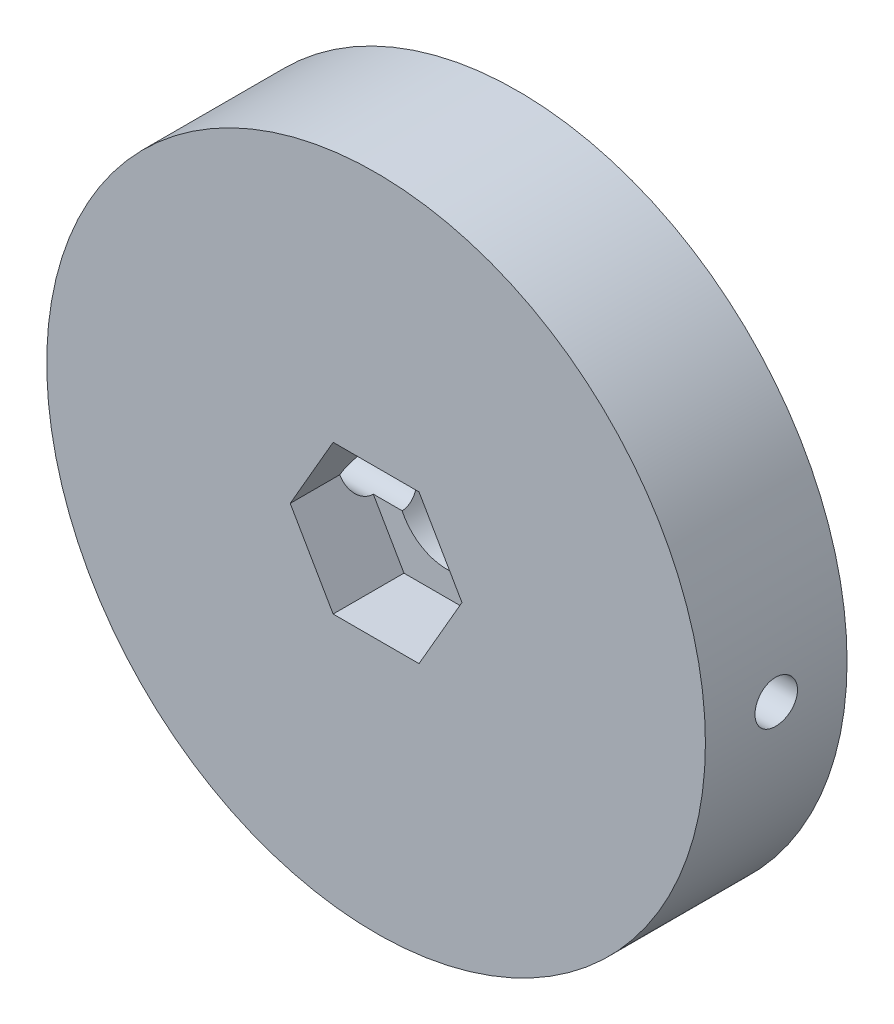
ISO-10303-21;
HEADER;
FILE_DESCRIPTION(('STEP AP214'),'2;1');
FILE_NAME('part.step','',(''),(''),'','','');
FILE_SCHEMA(('AUTOMOTIVE_DESIGN { 1 0 10303 214 1 1 1 1 }'));
ENDSEC;
DATA;
#1=APPLICATION_CONTEXT('core data for automotive mechanical design processes');
#2=APPLICATION_PROTOCOL_DEFINITION('international standard','automotive_design',2000,#1);
#3=PRODUCT_CONTEXT('',#1,'mechanical');
#4=PRODUCT('Part','Part','',(#3));
#5=PRODUCT_RELATED_PRODUCT_CATEGORY('part','',(#4));
#6=PRODUCT_DEFINITION_FORMATION('','',#4);
#7=PRODUCT_DEFINITION_CONTEXT('part definition',#1,'design');
#8=PRODUCT_DEFINITION('design','',#6,#7);
#9=PRODUCT_DEFINITION_SHAPE('','',#8);
#10=(LENGTH_UNIT() NAMED_UNIT(*) SI_UNIT(.MILLI.,.METRE.));
#11=(NAMED_UNIT(*) PLANE_ANGLE_UNIT() SI_UNIT($,.RADIAN.));
#12=(NAMED_UNIT(*) SI_UNIT($,.STERADIAN.) SOLID_ANGLE_UNIT());
#13=UNCERTAINTY_MEASURE_WITH_UNIT(LENGTH_MEASURE(1.E-05),#10,'distance_accuracy_value','');
#14=(GEOMETRIC_REPRESENTATION_CONTEXT(3) GLOBAL_UNCERTAINTY_ASSIGNED_CONTEXT((#13)) GLOBAL_UNIT_ASSIGNED_CONTEXT((#10,
#11,#12)) REPRESENTATION_CONTEXT('',''));
#15=CARTESIAN_POINT('',(0.,0.,0.));
#16=DIRECTION('',(0.,0.,1.));
#17=DIRECTION('',(1.,0.,0.));
#18=AXIS2_PLACEMENT_3D('',#15,#16,#17);
#19=CARTESIAN_POINT('',(0.,0.,10.));
#20=DIRECTION('',(0.,0.,-1.));
#21=DIRECTION('',(-1.,0.,0.));
#22=AXIS2_PLACEMENT_3D('',#19,#20,#21);
#23=CYLINDRICAL_SURFACE('',#22,3.5);
#24=CARTESIAN_POINT('',(0.,0.,0.));
#25=DIRECTION('',(0.,0.,1.));
#26=DIRECTION('',(1.,0.,0.));
#27=AXIS2_PLACEMENT_3D('',#24,#25,#26);
#28=CIRCLE('',#27,3.5);
#29=CARTESIAN_POINT('',(3.5,0.,0.));
#30=VERTEX_POINT('',#29);
#31=EDGE_CURVE('E263',#30,#30,#28,.T.);
#32=ORIENTED_EDGE('',*,*,#31,.F.);
#33=EDGE_LOOP('',(#32));
#34=FACE_BOUND('',#33,.T.);
#35=CARTESIAN_POINT('',(3.5,0.,3.5));
#36=CARTESIAN_POINT('',(3.49999299268884,-0.0801521976824074,3.50000922143898));
#37=CARTESIAN_POINT('',(3.4972151640971,-0.160419992198246,3.50646212975561));
#38=CARTESIAN_POINT('',(3.48637069204866,-0.318671611361218,3.53203970728539));
#39=CARTESIAN_POINT('',(3.47829069608751,-0.396649149090581,3.55119636978955));
#40=CARTESIAN_POINT('',(3.45770786336707,-0.547768164746414,3.60133527519899));
#41=CARTESIAN_POINT('',(3.44522036823866,-0.620925386146739,3.63227652746266));
#42=CARTESIAN_POINT('',(3.41702837926819,-0.760936446071888,3.70493210375049));
#43=CARTESIAN_POINT('',(3.40132475720839,-0.827791985611419,3.74664350915098));
#44=CARTESIAN_POINT('',(3.36733908702934,-0.956920783546129,3.84196385412534));
#45=CARTESIAN_POINT('',(3.34896947381213,-1.01882024425246,3.89604763807764));
#46=CARTESIAN_POINT('',(3.3120882776969,-1.13299518436931,4.01357192611615));
#47=CARTESIAN_POINT('',(3.29357662187922,-1.18526532055665,4.07701759007029));
#48=CARTESIAN_POINT('',(3.25741027462364,-1.28142843548186,4.21551636370652));
#49=CARTESIAN_POINT('',(3.23985230076501,-1.32473406006014,4.29100522964247));
#50=CARTESIAN_POINT('',(3.2089808436345,-1.39786599574425,4.44905471346701));
#51=CARTESIAN_POINT('',(3.19566505070703,-1.42769964537364,4.53161145208013));
#52=CARTESIAN_POINT('',(3.17573899533535,-1.47147459991436,4.69715036930945));
#53=CARTESIAN_POINT('',(3.16882610719817,-1.48613747209695,4.77990385092736));
#54=CARTESIAN_POINT('',(3.16162424842019,-1.50140303570396,4.94696298476757));
#55=CARTESIAN_POINT('',(3.16133131294301,-1.50201414304565,5.03126767764994));
#56=CARTESIAN_POINT('',(3.16714786968021,-1.48969999758096,5.19164995184879));
#57=CARTESIAN_POINT('',(3.17273435527608,-1.47788056910827,5.26783531160627));
#58=CARTESIAN_POINT('',(3.18879205821456,-1.44290386406528,5.41701379288904));
#59=CARTESIAN_POINT('',(3.19926427650311,-1.41974426417223,5.49000625692878));
#60=CARTESIAN_POINT('',(3.22415342810443,-1.36228829534658,5.63262357573777));
#61=CARTESIAN_POINT('',(3.23865147551049,-1.32775987214028,5.70214014711449));
#62=CARTESIAN_POINT('',(3.26994246945713,-1.24871152436691,5.8346731620293));
#63=CARTESIAN_POINT('',(3.28673634798109,-1.20418753740296,5.89768694746324));
#64=CARTESIAN_POINT('',(3.32256202266195,-1.10171702696058,6.02138875181234));
#65=CARTESIAN_POINT('',(3.34165927694226,-1.04292364428052,6.08135836473643));
#66=CARTESIAN_POINT('',(3.3786730287964,-0.915936662025533,6.19083579532753));
#67=CARTESIAN_POINT('',(3.39658921627429,-0.847740608139989,6.24034087293899));
#68=CARTESIAN_POINT('',(3.4297984684468,-0.701592911506315,6.32862196640361));
#69=CARTESIAN_POINT('',(3.44501227516835,-0.623435574851147,6.36708950935282));
#70=CARTESIAN_POINT('',(3.47048698130307,-0.460939847079478,6.43007511880733));
#71=CARTESIAN_POINT('',(3.48075078019998,-0.376605107828833,6.45460135298884));
#72=CARTESIAN_POINT('',(3.49461763446686,-0.210138119470685,6.48746693022949));
#73=CARTESIAN_POINT('',(3.49861624982293,-0.12822898050547,6.49676938265719));
#74=CARTESIAN_POINT('',(3.50077708325871,0.0360716505592619,6.50181478820412));
#75=CARTESIAN_POINT('',(3.49894110265833,0.118462985950311,6.4975619262662));
#76=CARTESIAN_POINT('',(3.48989338160075,0.276771219813305,6.47629218397258));
#77=CARTESIAN_POINT('',(3.48297259736823,0.352799465751996,6.4599658392758));
#78=CARTESIAN_POINT('',(3.46476944004986,0.500945568196324,6.41598955288096));
#79=CARTESIAN_POINT('',(3.45348652424256,0.573062936850433,6.38833820213907));
#80=CARTESIAN_POINT('',(3.42719375756864,0.713888482619006,6.32159942024878));
#81=CARTESIAN_POINT('',(3.41207852694255,0.782419874757532,6.28218183488638));
#82=CARTESIAN_POINT('',(3.37971494195701,0.912142452825177,6.19339052776262));
#83=CARTESIAN_POINT('',(3.36246567824312,0.973330487571132,6.14401255599057));
#84=CARTESIAN_POINT('',(3.32607394349023,1.09148379765634,6.03235520607617));
#85=CARTESIAN_POINT('',(3.30688677499573,1.14778308774279,5.96938389496011));
#86=CARTESIAN_POINT('',(3.26992018844849,1.24921715724402,5.83460885069339));
#87=CARTESIAN_POINT('',(3.25214116277359,1.29434883220193,5.76280266984699));
#88=CARTESIAN_POINT('',(3.21981484643715,1.37281937806384,5.61059307348568));
#89=CARTESIAN_POINT('',(3.20533127997694,1.40593207473353,5.53005849534316));
#90=CARTESIAN_POINT('',(3.18206803761103,1.45782942550893,5.36373683676198));
#91=CARTESIAN_POINT('',(3.17328328988834,1.47662682249981,5.27795450132941));
#92=CARTESIAN_POINT('',(3.16321740581935,1.49805974083904,5.11100441338137));
#93=CARTESIAN_POINT('',(3.16138962881681,1.50187346166243,5.03002036462019));
#94=CARTESIAN_POINT('',(3.16397809086751,1.49641325085791,4.86860512816848));
#95=CARTESIAN_POINT('',(3.16839322866983,1.48714162748685,4.7881738454847));
#96=CARTESIAN_POINT('',(3.1824582711803,1.45678214099437,4.63447914613377));
#97=CARTESIAN_POINT('',(3.19182357178317,1.43633482013379,4.56106058335268));
#98=CARTESIAN_POINT('',(3.21449437287189,1.38485117000436,4.41868963782594));
#99=CARTESIAN_POINT('',(3.22780099349553,1.35381183006239,4.34973853154671));
#100=CARTESIAN_POINT('',(3.25787626150961,1.27981602227022,4.2135895630917));
#101=CARTESIAN_POINT('',(3.27480834339631,1.23624027712767,4.14676510617978));
#102=CARTESIAN_POINT('',(3.3097987990854,1.13924888881305,4.02100913646911));
#103=CARTESIAN_POINT('',(3.32785759700647,1.08582952534294,3.96208062245602));
#104=CARTESIAN_POINT('',(3.36477750877144,0.965671675541752,3.84899690268563));
#105=CARTESIAN_POINT('',(3.38358948911939,0.898214817981345,3.79558526613148));
#106=CARTESIAN_POINT('',(3.41848089249468,0.754612613706936,3.70078507330686));
#107=CARTESIAN_POINT('',(3.43455907522587,0.678463349382711,3.65940196825022));
#108=CARTESIAN_POINT('',(3.46197513636854,0.520626802896572,3.59065543042933));
#109=CARTESIAN_POINT('',(3.47337868320289,0.439036402858197,3.5630964700207));
#110=CARTESIAN_POINT('',(3.49042295491409,0.271925657404337,3.5223652852328));
#111=CARTESIAN_POINT('',(3.49608152963086,0.186418352711325,3.50914849035336));
#112=CARTESIAN_POINT('',(3.49952115812385,0.0670267606132192,3.50111948904598));
#113=CARTESIAN_POINT('',(3.50000293079341,0.0335234910607503,3.4999961431522));
#114=CARTESIAN_POINT('',(3.5,0.,3.5));
#115=B_SPLINE_CURVE_WITH_KNOTS('',3,(#35,#36,#37,#38,#39,#40,#41,#42,#43,#44,#45,#46,#47,#48,
#49,#50,#51,#52,#53,#54,#55,#56,#57,#58,#59,#60,#61,#62,#63,#64,#65,#66,#67,#68,#69,#70,#71,#72,
#73,#74,#75,#76,#77,#78,#79,#80,#81,#82,#83,#84,#85,#86,#87,#88,#89,#90,#91,#92,#93,#94,#95,#96,
#97,#98,#99,#100,#101,#102,#103,#104,#105,#106,#107,#108,#109,#110,#111,#112,#113,#114),
.UNSPECIFIED.,.T.,.F.,(4,2,2,2,2,2,2,2,2,2,2,2,2,2,2,2,2,2,2,2,2,2,2,2,2,2,2,2,2,2,2,2,2,2,2,2,
2,2,2,4),(0.,0.240357161374425,0.481321951711674,0.721456131375709,0.961525304807658,
1.21311371779253,1.46484131710872,1.72984780430031,1.99470976114132,2.2462971341405,
2.49773382188957,2.72855360159807,2.95942069041216,3.19532704432402,3.43132944942385,
3.68854918859162,3.94583619550723,4.20973622296859,4.47348148178613,4.71978673747256,
4.96601595851026,5.19915597113058,5.43232499957122,5.67277527577345,5.91332836788289,
6.17201425189602,6.43077196675482,6.69417345394932,6.95734019712949,7.19934244432576,
7.44130200762144,7.67066022550943,7.90008369050323,8.14372375039557,8.38745608120076,
8.65042084666959,8.91350460007056,9.17275427816965,9.43119596989053,9.53172485598109),.UNSPECIFIED.);
#116=CARTESIAN_POINT('',(3.16227766016838,1.5,5.));
#117=VERTEX_POINT('',#116);
#118=CARTESIAN_POINT('',(3.16227766016838,-1.5,5.));
#119=VERTEX_POINT('',#118);
#120=EDGE_CURVE('E171',#117,#119,#115,.T.);
#121=ORIENTED_EDGE('',*,*,#120,.F.);
#122=CARTESIAN_POINT('',(0.,0.,5.));
#123=DIRECTION('',(0.,0.,1.));
#124=DIRECTION('',(1.,0.,0.));
#125=AXIS2_PLACEMENT_3D('',#122,#123,#124);
#126=CIRCLE('',#125,3.5);
#127=CARTESIAN_POINT('',(-3.16227766016838,1.5,5.));
#128=VERTEX_POINT('',#127);
#129=EDGE_CURVE('E157',#117,#128,#126,.T.);
#130=ORIENTED_EDGE('',*,*,#129,.T.);
#131=CARTESIAN_POINT('',(-3.5,0.,6.5));
#132=CARTESIAN_POINT('',(-3.49999299268885,-0.0801521976824066,6.49999077856102));
#133=CARTESIAN_POINT('',(-3.4972151640971,-0.160419992198245,6.4935378702444));
#134=CARTESIAN_POINT('',(-3.48637069204866,-0.318671611361216,6.46796029271462));
#135=CARTESIAN_POINT('',(-3.47829069608751,-0.396649149090579,6.44880363021045));
#136=CARTESIAN_POINT('',(-3.45770786336707,-0.547768164746412,6.39866472480102));
#137=CARTESIAN_POINT('',(-3.44522036823866,-0.620925386146736,6.36772347253735));
#138=CARTESIAN_POINT('',(-3.4170283792682,-0.760936446071885,6.29506789624952));
#139=CARTESIAN_POINT('',(-3.40132475720839,-0.827791985611416,6.25335649084902));
#140=CARTESIAN_POINT('',(-3.36733908702934,-0.956920783546126,6.15803614587467));
#141=CARTESIAN_POINT('',(-3.34896947381213,-1.01882024425246,6.10395236192237));
#142=CARTESIAN_POINT('',(-3.3120882776969,-1.13299518436931,5.98642807388386));
#143=CARTESIAN_POINT('',(-3.29357662187922,-1.18526532055664,5.92298240992972));
#144=CARTESIAN_POINT('',(-3.25741027462364,-1.28142843548186,5.78448363629348));
#145=CARTESIAN_POINT('',(-3.23985230076501,-1.32473406006014,5.70899477035753));
#146=CARTESIAN_POINT('',(-3.2089808436345,-1.39786599574424,5.55094528653299));
#147=CARTESIAN_POINT('',(-3.19566505070703,-1.42769964537364,5.46838854791988));
#148=CARTESIAN_POINT('',(-3.17573899533535,-1.47147459991436,5.30284963069055));
#149=CARTESIAN_POINT('',(-3.16882610719817,-1.48613747209695,5.22009614907264));
#150=CARTESIAN_POINT('',(-3.16162424842019,-1.50140303570396,5.05303701523244));
#151=CARTESIAN_POINT('',(-3.16133131294301,-1.50201414304565,4.96873232235007));
#152=CARTESIAN_POINT('',(-3.16714786968021,-1.48969999758096,4.80835004815122));
#153=CARTESIAN_POINT('',(-3.17273435527608,-1.47788056910827,4.73216468839374));
#154=CARTESIAN_POINT('',(-3.18879205821456,-1.44290386406528,4.58298620711097));
#155=CARTESIAN_POINT('',(-3.19926427650311,-1.41974426417223,4.50999374307123));
#156=CARTESIAN_POINT('',(-3.22415342810443,-1.36228829534658,4.36737642426223));
#157=CARTESIAN_POINT('',(-3.23865147551049,-1.32775987214028,4.29785985288551));
#158=CARTESIAN_POINT('',(-3.26994246945713,-1.24871152436691,4.16532683797071));
#159=CARTESIAN_POINT('',(-3.28673634798109,-1.20418753740296,4.10231305253676));
#160=CARTESIAN_POINT('',(-3.32256202266195,-1.10171702696058,3.97861124818766));
#161=CARTESIAN_POINT('',(-3.34165927694226,-1.04292364428052,3.91864163526357));
#162=CARTESIAN_POINT('',(-3.3786730287964,-0.915936662025533,3.80916420467247));
#163=CARTESIAN_POINT('',(-3.39658921627429,-0.847740608139988,3.75965912706102));
#164=CARTESIAN_POINT('',(-3.4297984684468,-0.701592911506315,3.67137803359639));
#165=CARTESIAN_POINT('',(-3.44501227516835,-0.623435574851147,3.63291049064718));
#166=CARTESIAN_POINT('',(-3.47048698130307,-0.460939847079478,3.56992488119267));
#167=CARTESIAN_POINT('',(-3.48075078019998,-0.376605107828833,3.54539864701116));
#168=CARTESIAN_POINT('',(-3.49461763446686,-0.210138119470685,3.51253306977051));
#169=CARTESIAN_POINT('',(-3.49861624982293,-0.12822898050547,3.50323061734281));
#170=CARTESIAN_POINT('',(-3.50077708325871,0.0360716505592612,3.49818521179589));
#171=CARTESIAN_POINT('',(-3.49894110265833,0.11846298595031,3.50243807373381));
#172=CARTESIAN_POINT('',(-3.48989338160075,0.276771219813304,3.52370781602742));
#173=CARTESIAN_POINT('',(-3.48297259736823,0.352799465751994,3.54003416072421));
#174=CARTESIAN_POINT('',(-3.46476944004986,0.500945568196321,3.58401044711904));
#175=CARTESIAN_POINT('',(-3.45348652424256,0.573062936850431,3.61166179786093));
#176=CARTESIAN_POINT('',(-3.42719375756864,0.713888482619004,3.67840057975122));
#177=CARTESIAN_POINT('',(-3.41207852694255,0.78241987475753,3.71781816511362));
#178=CARTESIAN_POINT('',(-3.37971494195701,0.912142452825174,3.80660947223738));
#179=CARTESIAN_POINT('',(-3.36246567824312,0.973330487571129,3.85598744400943));
#180=CARTESIAN_POINT('',(-3.32607394349023,1.09148379765634,3.96764479392383));
#181=CARTESIAN_POINT('',(-3.30688677499573,1.14778308774279,4.03061610503989));
#182=CARTESIAN_POINT('',(-3.26992018844849,1.24921715724402,4.16539114930661));
#183=CARTESIAN_POINT('',(-3.25214116277359,1.29434883220193,4.237197330153));
#184=CARTESIAN_POINT('',(-3.21981484643715,1.37281937806384,4.38940692651431));
#185=CARTESIAN_POINT('',(-3.20533127997694,1.40593207473353,4.46994150465684));
#186=CARTESIAN_POINT('',(-3.18206803761104,1.45782942550893,4.63626316323802));
#187=CARTESIAN_POINT('',(-3.17328328988834,1.47662682249981,4.72204549867059));
#188=CARTESIAN_POINT('',(-3.16321740581935,1.49805974083904,4.88899558661863));
#189=CARTESIAN_POINT('',(-3.16138962881681,1.50187346166243,4.96997963537981));
#190=CARTESIAN_POINT('',(-3.16397809086751,1.49641325085791,5.13139487183152));
#191=CARTESIAN_POINT('',(-3.16839322866983,1.48714162748685,5.2118261545153));
#192=CARTESIAN_POINT('',(-3.1824582711803,1.45678214099437,5.36552085386623));
#193=CARTESIAN_POINT('',(-3.19182357178317,1.43633482013379,5.43893941664732));
#194=CARTESIAN_POINT('',(-3.21449437287189,1.38485117000436,5.58131036217406));
#195=CARTESIAN_POINT('',(-3.22780099349553,1.35381183006239,5.65026146845329));
#196=CARTESIAN_POINT('',(-3.25787626150961,1.27981602227022,5.7864104369083));
#197=CARTESIAN_POINT('',(-3.27480834339631,1.23624027712767,5.85323489382022));
#198=CARTESIAN_POINT('',(-3.3097987990854,1.13924888881305,5.97899086353089));
#199=CARTESIAN_POINT('',(-3.32785759700647,1.08582952534293,6.03791937754398));
#200=CARTESIAN_POINT('',(-3.36477750877144,0.96567167554175,6.15100309731437));
#201=CARTESIAN_POINT('',(-3.38358948911939,0.898214817981343,6.20441473386853));
#202=CARTESIAN_POINT('',(-3.41848089249468,0.754612613706934,6.29921492669315));
#203=CARTESIAN_POINT('',(-3.43455907522587,0.67846334938271,6.34059803174978));
#204=CARTESIAN_POINT('',(-3.46197513636854,0.52062680289657,6.40934456957067));
#205=CARTESIAN_POINT('',(-3.47337868320289,0.439036402858197,6.43690352997931));
#206=CARTESIAN_POINT('',(-3.49042295491409,0.271925657404337,6.4776347147672));
#207=CARTESIAN_POINT('',(-3.49608152963086,0.186418352711325,6.49085150964664));
#208=CARTESIAN_POINT('',(-3.49952115812385,0.0670267606132196,6.49888051095403));
#209=CARTESIAN_POINT('',(-3.50000293079341,0.0335234910607508,6.5000038568478));
#210=CARTESIAN_POINT('',(-3.5,0.,6.5));
#211=B_SPLINE_CURVE_WITH_KNOTS('',3,(#131,#132,#133,#134,#135,#136,#137,#138,#139,#140,#141,
#142,#143,#144,#145,#146,#147,#148,#149,#150,#151,#152,#153,#154,#155,#156,#157,#158,#159,#160,
#161,#162,#163,#164,#165,#166,#167,#168,#169,#170,#171,#172,#173,#174,#175,#176,#177,#178,#179,
#180,#181,#182,#183,#184,#185,#186,#187,#188,#189,#190,#191,#192,#193,#194,#195,#196,#197,#198,
#199,#200,#201,#202,#203,#204,#205,#206,#207,#208,#209,#210),.UNSPECIFIED.,.T.,.F.,(4,2,2,2,2,2,
2,2,2,2,2,2,2,2,2,2,2,2,2,2,2,2,2,2,2,2,2,2,2,2,2,2,2,2,2,2,2,2,2,4),(0.,0.240357161374424,
0.481321951711673,0.721456131375707,0.961525304807654,1.21311371779253,1.46484131710871,
1.72984780430031,1.99470976114131,2.2462971341405,2.49773382188957,2.72855360159806,
2.95942069041216,3.19532704432402,3.43132944942385,3.68854918859162,3.94583619550723,
4.20973622296859,4.47348148178613,4.71978673747256,4.96601595851026,5.19915597113058,
5.43232499957121,5.67277527577344,5.91332836788288,6.17201425189601,6.43077196675482,
6.69417345394932,6.95734019712949,7.19934244432576,7.44130200762144,7.67066022550943,
7.90008369050323,8.14372375039557,8.38745608120077,8.65042084666959,8.91350460007056,
9.17275427816965,9.43119596989053,9.53172485598109),.UNSPECIFIED.);
#212=CARTESIAN_POINT('',(-3.16227766016838,-1.5,5.));
#213=VERTEX_POINT('',#212);
#214=EDGE_CURVE('E179',#213,#128,#211,.T.);
#215=ORIENTED_EDGE('',*,*,#214,.F.);
#216=EDGE_CURVE('E167',#213,#119,#126,.T.);
#217=ORIENTED_EDGE('',*,*,#216,.T.);
#218=EDGE_LOOP('',(#121,#130,#215,#217));
#219=FACE_BOUND('',#218,.T.);
#220=ADVANCED_FACE('F35',(#34,#219),#23,.F.);
#221=CARTESIAN_POINT('',(-23.25,0.,5.));
#222=DIRECTION('',(1.,0.,0.));
#223=DIRECTION('',(0.,0.,-1.));
#224=AXIS2_PLACEMENT_3D('',#221,#222,#223);
#225=CYLINDRICAL_SURFACE('',#224,1.5);
#226=CARTESIAN_POINT('',(23.25,0.,3.5));
#227=CARTESIAN_POINT('',(23.2499993575194,-0.0841617407544875,3.50000370098235));
#228=CARTESIAN_POINT('',(23.2495381336033,-0.168382273316844,3.50710700230322));
#229=CARTESIAN_POINT('',(23.2477425617024,-0.334497422879522,3.53534130107231));
#230=CARTESIAN_POINT('',(23.246407199784,-0.416389223487859,3.55648858888908));
#231=CARTESIAN_POINT('',(23.2430144034251,-0.575416705015012,3.61220058299807));
#232=CARTESIAN_POINT('',(23.2409573522777,-0.652554885091158,3.64675816803875));
#233=CARTESIAN_POINT('',(23.2363524812359,-0.799915643408826,3.72829814425515));
#234=CARTESIAN_POINT('',(23.2338047731445,-0.870139791609991,3.77527770581892));
#235=CARTESIAN_POINT('',(23.2285004008886,-1.00181051361919,3.88040958733033));
#236=CARTESIAN_POINT('',(23.2257434492315,-1.06324466351136,3.93857745419603));
#237=CARTESIAN_POINT('',(23.2203337645789,-1.17548521251709,4.06440263047956));
#238=CARTESIAN_POINT('',(23.2176810359603,-1.22629116567894,4.13206033788558));
#239=CARTESIAN_POINT('',(23.2127767164856,-1.31587187259357,4.2750155924208));
#240=CARTESIAN_POINT('',(23.2105254728961,-1.35463623219941,4.35031966581885));
#241=CARTESIAN_POINT('',(23.2066817436723,-1.41896687972332,4.50638431934662));
#242=CARTESIAN_POINT('',(23.2050892505724,-1.44453331721711,4.5871448376252));
#243=CARTESIAN_POINT('',(23.202745362278,-1.48170770781305,4.7517095827016));
#244=CARTESIAN_POINT('',(23.2019927884446,-1.49333522278137,4.83550937350919));
#245=CARTESIAN_POINT('',(23.2014100779356,-1.50236209714869,5.00387441508209));
#246=CARTESIAN_POINT('',(23.2015799302355,-1.49976162659779,5.08843965668682));
#247=CARTESIAN_POINT('',(23.2028218236265,-1.48042257456794,5.25580174498185));
#248=CARTESIAN_POINT('',(23.203892513396,-1.46370516937816,5.3386010500594));
#249=CARTESIAN_POINT('',(23.2068132964037,-1.41663964441904,5.50021582723453));
#250=CARTESIAN_POINT('',(23.2086633945616,-1.38629143861186,5.57903127418244));
#251=CARTESIAN_POINT('',(23.2129360588973,-1.31280177452263,5.7305090386428));
#252=CARTESIAN_POINT('',(23.2153590542523,-1.26965071897356,5.803166687431));
#253=CARTESIAN_POINT('',(23.2205040351617,-1.17178720727461,5.94021532815866));
#254=CARTESIAN_POINT('',(23.2232260243047,-1.11707461234881,6.00460622085536));
#255=CARTESIAN_POINT('',(23.2286682495912,-0.99752188518117,6.12341672918544));
#256=CARTESIAN_POINT('',(23.2313884734403,-0.93266342775974,6.17781790743294));
#257=CARTESIAN_POINT('',(23.2365158443952,-0.794724285488825,6.27496249205618));
#258=CARTESIAN_POINT('',(23.2389229913847,-0.72164359758723,6.3177058941045));
#259=CARTESIAN_POINT('',(23.2431531738402,-0.569323237578535,6.39032007152259));
#260=CARTESIAN_POINT('',(23.2449761771655,-0.490083226871654,6.42019013860797));
#261=CARTESIAN_POINT('',(23.2478322225902,-0.327698592784928,6.46619737789848));
#262=CARTESIAN_POINT('',(23.2488652745188,-0.24455401800245,6.4823347209774));
#263=CARTESIAN_POINT('',(23.2500237439872,-0.0768803815852869,6.5003955634332));
#264=CARTESIAN_POINT('',(23.2501507891539,0.00764592373997359,6.50234455209622));
#265=CARTESIAN_POINT('',(23.249487259948,0.175824244255039,6.49203997522431));
#266=CARTESIAN_POINT('',(23.2486966906684,0.2594762642947,6.47978648851594));
#267=CARTESIAN_POINT('',(23.2462879706641,0.423459560262003,6.44144589942643));
#268=CARTESIAN_POINT('',(23.2446705201976,0.503793583975122,6.4153705016767));
#269=CARTESIAN_POINT('',(23.2407899831615,0.658945334414576,6.35013816901398));
#270=CARTESIAN_POINT('',(23.2385268904078,0.733763008296525,6.31098110880385));
#271=CARTESIAN_POINT('',(23.2336052509549,0.875874922299071,6.22063216076931));
#272=CARTESIAN_POINT('',(23.2309461472227,0.943158327253667,6.16942326086196));
#273=CARTESIAN_POINT('',(23.2255335664028,1.0681826737172,6.05644901261116));
#274=CARTESIAN_POINT('',(23.2227800883269,1.12592351526268,5.99468355369589));
#275=CARTESIAN_POINT('',(23.2174843713852,1.23031011971563,5.86223945831073));
#276=CARTESIAN_POINT('',(23.2149424511338,1.27693933804568,5.79154776765516));
#277=CARTESIAN_POINT('',(23.2103615909846,1.35766587052458,5.64332344432732));
#278=CARTESIAN_POINT('',(23.2083226478205,1.3917632660539,5.56579085608323));
#279=CARTESIAN_POINT('',(23.2049799819445,1.44642964318208,5.4061458776011));
#280=CARTESIAN_POINT('',(23.2036756947362,1.46700901381425,5.32403705711935));
#281=CARTESIAN_POINT('',(23.2019478657025,1.49408908970934,5.15752085353405));
#282=CARTESIAN_POINT('',(23.2015243144517,1.50058994563682,5.07311349503863));
#283=CARTESIAN_POINT('',(23.2016059508451,1.4993269837106,4.90456072888966));
#284=CARTESIAN_POINT('',(23.2021094451118,1.49158917477425,4.82041512429711));
#285=CARTESIAN_POINT('',(23.2039848471645,1.46212248112986,4.65462063522894));
#286=CARTESIAN_POINT('',(23.2053567565068,1.44039357134887,4.57297175522788));
#287=CARTESIAN_POINT('',(23.2088139719469,1.38356740395994,4.41448470993989));
#288=CARTESIAN_POINT('',(23.2108992705828,1.34847028618108,4.33764649434405));
#289=CARTESIAN_POINT('',(23.2155482450591,1.2659074771409,4.19094978449359));
#290=CARTESIAN_POINT('',(23.2181119089225,1.21844209553787,4.12109111555599));
#291=CARTESIAN_POINT('',(23.2234341928912,1.11239373185373,3.99020446937162));
#292=CARTESIAN_POINT('',(23.2261931387391,1.05379188548028,3.92919179024936));
#293=CARTESIAN_POINT('',(23.2315922937163,0.927160589434561,3.81784853589546));
#294=CARTESIAN_POINT('',(23.2342324736581,0.859128838882429,3.76752057532664));
#295=CARTESIAN_POINT('',(23.239099502098,0.715487009746572,3.67893581846996));
#296=CARTESIAN_POINT('',(23.2413258135451,0.639867277848043,3.64069466204996));
#297=CARTESIAN_POINT('',(23.2451071378512,0.483320825810499,3.57749863878158));
#298=CARTESIAN_POINT('',(23.2466629352869,0.402400436518006,3.55252823563747));
#299=CARTESIAN_POINT('',(23.2485209252802,0.267488695786389,3.52306156471822));
#300=CARTESIAN_POINT('',(23.2490731082679,0.214369055618321,3.51442468672909));
#301=CARTESIAN_POINT('',(23.2498128505782,0.107507607629345,3.50289272646141));
#302=CARTESIAN_POINT('',(23.2500004104416,0.0537658007311814,3.49999763566821));
#303=CARTESIAN_POINT('',(23.25,0.,3.5));
#304=B_SPLINE_CURVE_WITH_KNOTS('',3,(#226,#227,#228,#229,#230,#231,#232,#233,#234,#235,#236,
#237,#238,#239,#240,#241,#242,#243,#244,#245,#246,#247,#248,#249,#250,#251,#252,#253,#254,#255,
#256,#257,#258,#259,#260,#261,#262,#263,#264,#265,#266,#267,#268,#269,#270,#271,#272,#273,#274,
#275,#276,#277,#278,#279,#280,#281,#282,#283,#284,#285,#286,#287,#288,#289,#290,#291,#292,#293,
#294,#295,#296,#297,#298,#299,#300,#301,#302,#303),.UNSPECIFIED.,.T.,.F.,(4,2,2,2,2,2,2,2,2,2,2,
2,2,2,2,2,2,2,2,2,2,2,2,2,2,2,2,2,2,2,2,2,2,2,2,2,2,2,4),(0.,0.252288942948316,
0.504871041629657,0.757319195130733,1.00970989273236,1.2624538718486,1.51520845379964,
1.76818060782224,2.02114989477794,2.27376374778225,2.5263745816019,2.77860715504705,
3.03084132061103,3.28326504563161,3.53569180072677,3.78857986144226,4.04146801603067,
4.29437008262181,4.54726900235246,4.79971347844827,5.05215655343371,5.30438619600383,
5.5566182545174,5.80920851606253,6.06180142345797,6.31476810973686,6.56773315324521,
6.82050355688013,7.07327125541927,7.32557769657915,7.57788458988968,7.83018884418732,
8.08248678227136,8.33521596533926,8.58800692278675,8.84112365559631,9.09394340393068,
9.25511565425303,9.41628766556883),.UNSPECIFIED.);
#305=CARTESIAN_POINT('',(23.25,0.,3.5));
#306=VERTEX_POINT('',#305);
#307=EDGE_CURVE('E172',#306,#306,#304,.T.);
#308=ORIENTED_EDGE('',*,*,#307,.F.);
#309=EDGE_LOOP('',(#308));
#310=FACE_BOUND('',#309,.T.);
#311=DIRECTION('',(1.,0.,0.));
#312=VECTOR('',#311,1.);
#313=CARTESIAN_POINT('',(-23.25,-1.5,5.));
#314=LINE('',#313,#312);
#315=CARTESIAN_POINT('',(5.19615242270663,-1.5,5.));
#316=VERTEX_POINT('',#315);
#317=EDGE_CURVE('E169',#316,#119,#314,.F.);
#318=ORIENTED_EDGE('',*,*,#317,.F.);
#319=CARTESIAN_POINT('',(6.06217782649107,0.,5.));
#320=DIRECTION('',(0.866025403784439,-0.5,0.));
#321=DIRECTION('',(0.5,0.866025403784439,0.));
#322=AXIS2_PLACEMENT_3D('',#319,#320,#321);
#323=ELLIPSE('',#322,1.73205080756888,1.5);
#324=CARTESIAN_POINT('',(6.06217782649107,0.,6.5));
#325=VERTEX_POINT('',#324);
#326=EDGE_CURVE('E11',#316,#325,#323,.F.);
#327=ORIENTED_EDGE('',*,*,#326,.T.);
#328=CARTESIAN_POINT('',(6.06217782649107,0.,5.));
#329=DIRECTION('',(0.866025403784438,0.5,0.));
#330=DIRECTION('',(0.5,-0.866025403784439,0.));
#331=AXIS2_PLACEMENT_3D('',#328,#329,#330);
#332=ELLIPSE('',#331,1.73205080756888,1.5);
#333=CARTESIAN_POINT('',(5.19615242270663,1.5,5.));
#334=VERTEX_POINT('',#333);
#335=EDGE_CURVE('E44',#325,#334,#332,.F.);
#336=ORIENTED_EDGE('',*,*,#335,.T.);
#337=DIRECTION('',(1.,0.,0.));
#338=VECTOR('',#337,1.);
#339=CARTESIAN_POINT('',(-23.25,1.5,5.));
#340=LINE('',#339,#338);
#341=EDGE_CURVE('E118',#117,#334,#340,.T.);
#342=ORIENTED_EDGE('',*,*,#341,.F.);
#343=ORIENTED_EDGE('',*,*,#120,.T.);
#344=EDGE_LOOP('',(#318,#327,#336,#342,#343));
#345=FACE_BOUND('',#344,.T.);
#346=ADVANCED_FACE('F183',(#310,#345),#225,.F.);
#347=CARTESIAN_POINT('',(-23.25,0.,3.5));
#348=CARTESIAN_POINT('',(-23.2499993575195,0.0841617407544868,3.50000370098235));
#349=CARTESIAN_POINT('',(-23.2495381336033,0.168382273316843,3.50710700230322));
#350=CARTESIAN_POINT('',(-23.2477425617024,0.334497422879521,3.53534130107231));
#351=CARTESIAN_POINT('',(-23.246407199784,0.416389223487858,3.55648858888908));
#352=CARTESIAN_POINT('',(-23.2430144034251,0.575416705015011,3.61220058299807));
#353=CARTESIAN_POINT('',(-23.2409573522777,0.652554885091157,3.64675816803875));
#354=CARTESIAN_POINT('',(-23.2363524812359,0.799915643408824,3.72829814425515));
#355=CARTESIAN_POINT('',(-23.2338047731445,0.87013979160999,3.77527770581892));
#356=CARTESIAN_POINT('',(-23.2285004008886,1.00181051361919,3.88040958733033));
#357=CARTESIAN_POINT('',(-23.2257434492315,1.06324466351136,3.93857745419603));
#358=CARTESIAN_POINT('',(-23.2203337645789,1.17548521251709,4.06440263047956));
#359=CARTESIAN_POINT('',(-23.2176810359603,1.22629116567894,4.13206033788558));
#360=CARTESIAN_POINT('',(-23.2127767164856,1.31587187259357,4.2750155924208));
#361=CARTESIAN_POINT('',(-23.2105254728961,1.35463623219941,4.35031966581885));
#362=CARTESIAN_POINT('',(-23.2066817436723,1.41896687972332,4.50638431934662));
#363=CARTESIAN_POINT('',(-23.2050892505724,1.44453331721711,4.5871448376252));
#364=CARTESIAN_POINT('',(-23.202745362278,1.48170770781304,4.7517095827016));
#365=CARTESIAN_POINT('',(-23.2019927884446,1.49333522278137,4.83550937350919));
#366=CARTESIAN_POINT('',(-23.2014100779356,1.50236209714869,5.00387441508209));
#367=CARTESIAN_POINT('',(-23.2015799302355,1.49976162659779,5.08843965668682));
#368=CARTESIAN_POINT('',(-23.2028218236265,1.48042257456794,5.25580174498185));
#369=CARTESIAN_POINT('',(-23.203892513396,1.46370516937815,5.3386010500594));
#370=CARTESIAN_POINT('',(-23.2068132964037,1.41663964441904,5.50021582723453));
#371=CARTESIAN_POINT('',(-23.2086633945616,1.38629143861186,5.57903127418245));
#372=CARTESIAN_POINT('',(-23.2129360588973,1.31280177452263,5.73050903864281));
#373=CARTESIAN_POINT('',(-23.2153590542523,1.26965071897356,5.803166687431));
#374=CARTESIAN_POINT('',(-23.2205040351617,1.17178720727461,5.94021532815866));
#375=CARTESIAN_POINT('',(-23.2232260243047,1.1170746123488,6.00460622085536));
#376=CARTESIAN_POINT('',(-23.2286682495912,0.997521885181169,6.12341672918544));
#377=CARTESIAN_POINT('',(-23.2313884734403,0.932663427759739,6.17781790743294));
#378=CARTESIAN_POINT('',(-23.2365158443952,0.794724285488824,6.27496249205618));
#379=CARTESIAN_POINT('',(-23.2389229913847,0.721643597587229,6.3177058941045));
#380=CARTESIAN_POINT('',(-23.2431531738402,0.569323237578534,6.39032007152259));
#381=CARTESIAN_POINT('',(-23.2449761771655,0.490083226871652,6.42019013860797));
#382=CARTESIAN_POINT('',(-23.2478322225902,0.327698592784926,6.46619737789848));
#383=CARTESIAN_POINT('',(-23.2488652745188,0.244554018002448,6.4823347209774));
#384=CARTESIAN_POINT('',(-23.2500237439872,0.0768803815852849,6.5003955634332));
#385=CARTESIAN_POINT('',(-23.2501507891539,-0.00764592373997587,6.50234455209622));
#386=CARTESIAN_POINT('',(-23.249487259948,-0.175824244255041,6.49203997522431));
#387=CARTESIAN_POINT('',(-23.2486966906684,-0.259476264294702,6.47978648851594));
#388=CARTESIAN_POINT('',(-23.2462879706641,-0.423459560262005,6.44144589942643));
#389=CARTESIAN_POINT('',(-23.2446705201976,-0.503793583975123,6.4153705016767));
#390=CARTESIAN_POINT('',(-23.2407899831615,-0.658945334414577,6.35013816901398));
#391=CARTESIAN_POINT('',(-23.2385268904078,-0.733763008296527,6.31098110880385));
#392=CARTESIAN_POINT('',(-23.2336052509549,-0.875874922299072,6.22063216076931));
#393=CARTESIAN_POINT('',(-23.2309461472227,-0.943158327253668,6.16942326086196));
#394=CARTESIAN_POINT('',(-23.2255335664028,-1.0681826737172,6.05644901261116));
#395=CARTESIAN_POINT('',(-23.2227800883269,-1.12592351526268,5.99468355369589));
#396=CARTESIAN_POINT('',(-23.2174843713852,-1.23031011971563,5.86223945831072));
#397=CARTESIAN_POINT('',(-23.2149424511338,-1.27693933804568,5.79154776765516));
#398=CARTESIAN_POINT('',(-23.2103615909846,-1.35766587052459,5.64332344432732));
#399=CARTESIAN_POINT('',(-23.2083226478205,-1.39176326605391,5.56579085608323));
#400=CARTESIAN_POINT('',(-23.2049799819445,-1.44642964318209,5.4061458776011));
#401=CARTESIAN_POINT('',(-23.2036756947362,-1.46700901381426,5.32403705711935));
#402=CARTESIAN_POINT('',(-23.2019478657025,-1.49408908970934,5.15752085353405));
#403=CARTESIAN_POINT('',(-23.2015243144517,-1.50058994563682,5.07311349503863));
#404=CARTESIAN_POINT('',(-23.2016059508451,-1.4993269837106,4.90456072888966));
#405=CARTESIAN_POINT('',(-23.2021094451118,-1.49158917477425,4.82041512429711));
#406=CARTESIAN_POINT('',(-23.2039848471645,-1.46212248112986,4.65462063522894));
#407=CARTESIAN_POINT('',(-23.2053567565068,-1.44039357134887,4.57297175522788));
#408=CARTESIAN_POINT('',(-23.2088139719469,-1.38356740395994,4.41448470993989));
#409=CARTESIAN_POINT('',(-23.2108992705828,-1.34847028618108,4.33764649434405));
#410=CARTESIAN_POINT('',(-23.2155482450591,-1.26590747714091,4.19094978449359));
#411=CARTESIAN_POINT('',(-23.2181119089225,-1.21844209553787,4.12109111555599));
#412=CARTESIAN_POINT('',(-23.2234341928912,-1.11239373185373,3.99020446937162));
#413=CARTESIAN_POINT('',(-23.2261931387391,-1.05379188548028,3.92919179024936));
#414=CARTESIAN_POINT('',(-23.2315922937163,-0.927160589434562,3.81784853589546));
#415=CARTESIAN_POINT('',(-23.2342324736581,-0.85912883888243,3.76752057532664));
#416=CARTESIAN_POINT('',(-23.239099502098,-0.715487009746573,3.67893581846996));
#417=CARTESIAN_POINT('',(-23.2413258135451,-0.639867277848044,3.64069466204996));
#418=CARTESIAN_POINT('',(-23.2451071378512,-0.4833208258105,3.57749863878158));
#419=CARTESIAN_POINT('',(-23.2466629352869,-0.402400436518006,3.55252823563747));
#420=CARTESIAN_POINT('',(-23.2485209252802,-0.26748869578639,3.52306156471822));
#421=CARTESIAN_POINT('',(-23.2490731082679,-0.214369055618322,3.51442468672909));
#422=CARTESIAN_POINT('',(-23.2498128505782,-0.107507607629346,3.50289272646141));
#423=CARTESIAN_POINT('',(-23.2500004104416,-0.0537658007311824,3.49999763566821));
#424=CARTESIAN_POINT('',(-23.25,0.,3.5));
#425=B_SPLINE_CURVE_WITH_KNOTS('',3,(#347,#348,#349,#350,#351,#352,#353,#354,#355,#356,#357,
#358,#359,#360,#361,#362,#363,#364,#365,#366,#367,#368,#369,#370,#371,#372,#373,#374,#375,#376,
#377,#378,#379,#380,#381,#382,#383,#384,#385,#386,#387,#388,#389,#390,#391,#392,#393,#394,#395,
#396,#397,#398,#399,#400,#401,#402,#403,#404,#405,#406,#407,#408,#409,#410,#411,#412,#413,#414,
#415,#416,#417,#418,#419,#420,#421,#422,#423,#424),.UNSPECIFIED.,.T.,.F.,(4,2,2,2,2,2,2,2,2,2,2,
2,2,2,2,2,2,2,2,2,2,2,2,2,2,2,2,2,2,2,2,2,2,2,2,2,2,2,4),(0.,0.252288942948316,
0.504871041629657,0.757319195130732,1.00970989273236,1.2624538718486,1.51520845379964,
1.76818060782224,2.02114989477794,2.27376374778225,2.5263745816019,2.77860715504705,
3.03084132061103,3.28326504563161,3.53569180072677,3.78857986144226,4.04146801603067,
4.29437008262181,4.54726900235246,4.79971347844827,5.05215655343371,5.30438619600383,
5.5566182545174,5.80920851606253,6.06180142345797,6.31476810973686,6.5677331532452,
6.82050355688013,7.07327125541927,7.32557769657915,7.57788458988968,7.83018884418731,
8.08248678227136,8.33521596533926,8.58800692278675,8.84112365559631,9.09394340393068,
9.25511565425303,9.41628766556883),.UNSPECIFIED.);
#426=CARTESIAN_POINT('',(-23.25,0.,3.5));
#427=VERTEX_POINT('',#426);
#428=EDGE_CURVE('E178',#427,#427,#425,.T.);
#429=ORIENTED_EDGE('',*,*,#428,.F.);
#430=EDGE_LOOP('',(#429));
#431=FACE_BOUND('',#430,.T.);
#432=DIRECTION('',(1.,0.,0.));
#433=VECTOR('',#432,1.);
#434=CARTESIAN_POINT('',(-23.25,-1.5,5.));
#435=LINE('',#434,#433);
#436=CARTESIAN_POINT('',(-5.19615242270664,-1.5,5.));
#437=VERTEX_POINT('',#436);
#438=EDGE_CURVE('E214',#213,#437,#435,.F.);
#439=ORIENTED_EDGE('',*,*,#438,.F.);
#440=ORIENTED_EDGE('',*,*,#214,.T.);
#441=DIRECTION('',(1.,0.,0.));
#442=VECTOR('',#441,1.);
#443=CARTESIAN_POINT('',(-23.25,1.5,5.));
#444=LINE('',#443,#442);
#445=CARTESIAN_POINT('',(-5.19615242270664,1.5,5.));
#446=VERTEX_POINT('',#445);
#447=EDGE_CURVE('E205',#446,#128,#444,.T.);
#448=ORIENTED_EDGE('',*,*,#447,.F.);
#449=CARTESIAN_POINT('',(-6.06217782649108,0.,5.));
#450=DIRECTION('',(-0.866025403784439,0.5,0.));
#451=DIRECTION('',(0.5,0.866025403784439,0.));
#452=AXIS2_PLACEMENT_3D('',#449,#450,#451);
#453=ELLIPSE('',#452,1.73205080756888,1.5);
#454=CARTESIAN_POINT('',(-6.06217782649107,0.,6.5));
#455=VERTEX_POINT('',#454);
#456=EDGE_CURVE('E207',#446,#455,#453,.F.);
#457=ORIENTED_EDGE('',*,*,#456,.T.);
#458=CARTESIAN_POINT('',(-6.06217782649107,0.,5.));
#459=DIRECTION('',(-0.866025403784439,-0.5,0.));
#460=DIRECTION('',(0.5,-0.866025403784439,0.));
#461=AXIS2_PLACEMENT_3D('',#458,#459,#460);
#462=ELLIPSE('',#461,1.73205080756888,1.5);
#463=EDGE_CURVE('E211',#455,#437,#462,.F.);
#464=ORIENTED_EDGE('',*,*,#463,.T.);
#465=EDGE_LOOP('',(#439,#440,#448,#457,#464));
#466=FACE_BOUND('',#465,.T.);
#467=ADVANCED_FACE('F188',(#431,#466),#225,.F.);
#468=CARTESIAN_POINT('',(0.,0.,10.));
#469=DIRECTION('',(0.,0.,1.));
#470=DIRECTION('',(1.,0.,0.));
#471=AXIS2_PLACEMENT_3D('',#468,#469,#470);
#472=PLANE('',#471);
#473=DIRECTION('',(-0.5,0.866025403784438,0.));
#474=VECTOR('',#473,1.);
#475=CARTESIAN_POINT('',(6.06217782649107,0.,10.));
#476=LINE('',#475,#474);
#477=CARTESIAN_POINT('',(6.06217782649107,0.,10.));
#478=VERTEX_POINT('',#477);
#479=CARTESIAN_POINT('',(3.03108891324553,5.25,10.));
#480=VERTEX_POINT('',#479);
#481=EDGE_CURVE('E51',#478,#480,#476,.T.);
#482=ORIENTED_EDGE('',*,*,#481,.F.);
#483=DIRECTION('',(0.5,0.866025403784439,0.));
#484=VECTOR('',#483,1.);
#485=CARTESIAN_POINT('',(3.03108891324554,-5.25,10.));
#486=LINE('',#485,#484);
#487=CARTESIAN_POINT('',(3.03108891324554,-5.25,10.));
#488=VERTEX_POINT('',#487);
#489=EDGE_CURVE('E120',#488,#478,#486,.T.);
#490=ORIENTED_EDGE('',*,*,#489,.F.);
#491=DIRECTION('',(1.,0.,0.));
#492=VECTOR('',#491,1.);
#493=CARTESIAN_POINT('',(-3.03108891324554,-5.25,10.));
#494=LINE('',#493,#492);
#495=CARTESIAN_POINT('',(-3.03108891324554,-5.25,10.));
#496=VERTEX_POINT('',#495);
#497=EDGE_CURVE('E150',#496,#488,#494,.T.);
#498=ORIENTED_EDGE('',*,*,#497,.F.);
#499=DIRECTION('',(0.5,-0.866025403784439,0.));
#500=VECTOR('',#499,1.);
#501=CARTESIAN_POINT('',(-6.06217782649107,0.,10.));
#502=LINE('',#501,#500);
#503=CARTESIAN_POINT('',(-6.06217782649107,0.,10.));
#504=VERTEX_POINT('',#503);
#505=EDGE_CURVE('E147',#504,#496,#502,.T.);
#506=ORIENTED_EDGE('',*,*,#505,.F.);
#507=DIRECTION('',(-0.5,-0.866025403784439,0.));
#508=VECTOR('',#507,1.);
#509=CARTESIAN_POINT('',(-3.03108891324554,5.25,10.));
#510=LINE('',#509,#508);
#511=CARTESIAN_POINT('',(-3.03108891324554,5.25,10.));
#512=VERTEX_POINT('',#511);
#513=EDGE_CURVE('E144',#512,#504,#510,.T.);
#514=ORIENTED_EDGE('',*,*,#513,.F.);
#515=DIRECTION('',(-1.,0.,0.));
#516=VECTOR('',#515,1.);
#517=CARTESIAN_POINT('',(3.03108891324553,5.25,10.));
#518=LINE('',#517,#516);
#519=EDGE_CURVE('E142',#480,#512,#518,.T.);
#520=ORIENTED_EDGE('',*,*,#519,.F.);
#521=EDGE_LOOP('',(#482,#490,#498,#506,#514,#520));
#522=FACE_BOUND('',#521,.T.);
#523=CARTESIAN_POINT('',(0.,0.,10.));
#524=DIRECTION('',(0.,0.,1.));
#525=DIRECTION('',(1.,0.,0.));
#526=AXIS2_PLACEMENT_3D('',#523,#524,#525);
#527=CIRCLE('',#526,23.25);
#528=CARTESIAN_POINT('',(23.25,0.,10.));
#529=VERTEX_POINT('',#528);
#530=EDGE_CURVE('E208',#529,#529,#527,.T.);
#531=ORIENTED_EDGE('',*,*,#530,.T.);
#532=EDGE_LOOP('',(#531));
#533=FACE_BOUND('',#532,.T.);
#534=ADVANCED_FACE('F226',(#522,#533),#472,.T.);
#535=CARTESIAN_POINT('',(0.,0.,0.));
#536=DIRECTION('',(0.,0.,1.));
#537=DIRECTION('',(1.,0.,0.));
#538=AXIS2_PLACEMENT_3D('',#535,#536,#537);
#539=PLANE('',#538);
#540=CARTESIAN_POINT('',(0.,0.,0.));
#541=DIRECTION('',(0.,0.,1.));
#542=DIRECTION('',(1.,0.,0.));
#543=AXIS2_PLACEMENT_3D('',#540,#541,#542);
#544=CIRCLE('',#543,23.25);
#545=CARTESIAN_POINT('',(23.25,0.,0.));
#546=VERTEX_POINT('',#545);
#547=EDGE_CURVE('E265',#546,#546,#544,.T.);
#548=ORIENTED_EDGE('',*,*,#547,.F.);
#549=EDGE_LOOP('',(#548));
#550=FACE_BOUND('',#549,.T.);
#551=ORIENTED_EDGE('',*,*,#31,.T.);
#552=EDGE_LOOP('',(#551));
#553=FACE_BOUND('',#552,.T.);
#554=ADVANCED_FACE('F274',(#550,#553),#539,.F.);
#555=CARTESIAN_POINT('',(0.,0.,10.));
#556=DIRECTION('',(0.,0.,-1.));
#557=DIRECTION('',(-1.,0.,0.));
#558=AXIS2_PLACEMENT_3D('',#555,#556,#557);
#559=CYLINDRICAL_SURFACE('',#558,23.25);
#560=ORIENTED_EDGE('',*,*,#428,.T.);
#561=EDGE_LOOP('',(#560));
#562=FACE_BOUND('',#561,.T.);
#563=ORIENTED_EDGE('',*,*,#307,.T.);
#564=EDGE_LOOP('',(#563));
#565=FACE_BOUND('',#564,.T.);
#566=ORIENTED_EDGE('',*,*,#530,.F.);
#567=EDGE_LOOP('',(#566));
#568=FACE_BOUND('',#567,.T.);
#569=ORIENTED_EDGE('',*,*,#547,.T.);
#570=EDGE_LOOP('',(#569));
#571=FACE_BOUND('',#570,.T.);
#572=ADVANCED_FACE('F37',(#562,#565,#568,#571),#559,.T.);
#573=CARTESIAN_POINT('',(6.06217782649107,0.,5.));
#574=DIRECTION('',(0.866025403784438,0.5,0.));
#575=DIRECTION('',(-0.5,0.866025403784439,0.));
#576=AXIS2_PLACEMENT_3D('',#573,#574,#575);
#577=PLANE('',#576);
#578=DIRECTION('',(0.,0.,1.));
#579=VECTOR('',#578,1.);
#580=CARTESIAN_POINT('',(6.06217782649107,0.,5.));
#581=LINE('',#580,#579);
#582=EDGE_CURVE('E155',#325,#478,#581,.T.);
#583=ORIENTED_EDGE('',*,*,#582,.T.);
#584=ORIENTED_EDGE('',*,*,#481,.T.);
#585=DIRECTION('',(0.,0.,1.));
#586=VECTOR('',#585,1.);
#587=CARTESIAN_POINT('',(3.03108891324553,5.25,5.));
#588=LINE('',#587,#586);
#589=CARTESIAN_POINT('',(3.03108891324553,5.25,5.));
#590=VERTEX_POINT('',#589);
#591=EDGE_CURVE('E122',#590,#480,#588,.T.);
#592=ORIENTED_EDGE('',*,*,#591,.F.);
#593=DIRECTION('',(-0.5,0.866025403784438,0.));
#594=VECTOR('',#593,1.);
#595=CARTESIAN_POINT('',(6.06217782649107,0.,5.));
#596=LINE('',#595,#594);
#597=EDGE_CURVE('E113',#334,#590,#596,.T.);
#598=ORIENTED_EDGE('',*,*,#597,.F.);
#599=ORIENTED_EDGE('',*,*,#335,.F.);
#600=EDGE_LOOP('',(#583,#584,#592,#598,#599));
#601=FACE_BOUND('',#600,.T.);
#602=ADVANCED_FACE('F123',(#601),#577,.F.);
#603=CARTESIAN_POINT('',(3.03108891324554,-5.25,5.));
#604=DIRECTION('',(0.866025403784439,-0.5,0.));
#605=DIRECTION('',(0.5,0.866025403784439,0.));
#606=AXIS2_PLACEMENT_3D('',#603,#604,#605);
#607=PLANE('',#606);
#608=DIRECTION('',(0.5,0.866025403784439,0.));
#609=VECTOR('',#608,1.);
#610=CARTESIAN_POINT('',(3.03108891324554,-5.25,5.));
#611=LINE('',#610,#609);
#612=CARTESIAN_POINT('',(3.03108891324554,-5.25,5.));
#613=VERTEX_POINT('',#612);
#614=EDGE_CURVE('E128',#613,#316,#611,.T.);
#615=ORIENTED_EDGE('',*,*,#614,.F.);
#616=DIRECTION('',(0.,0.,1.));
#617=VECTOR('',#616,1.);
#618=CARTESIAN_POINT('',(3.03108891324554,-5.25,5.));
#619=LINE('',#618,#617);
#620=EDGE_CURVE('E158',#613,#488,#619,.T.);
#621=ORIENTED_EDGE('',*,*,#620,.T.);
#622=ORIENTED_EDGE('',*,*,#489,.T.);
#623=ORIENTED_EDGE('',*,*,#582,.F.);
#624=ORIENTED_EDGE('',*,*,#326,.F.);
#625=EDGE_LOOP('',(#615,#621,#622,#623,#624));
#626=FACE_BOUND('',#625,.T.);
#627=ADVANCED_FACE('F222',(#626),#607,.F.);
#628=CARTESIAN_POINT('',(-6.06217782649107,0.,5.));
#629=DIRECTION('',(-0.866025403784439,-0.5,0.));
#630=DIRECTION('',(0.5,-0.866025403784439,0.));
#631=AXIS2_PLACEMENT_3D('',#628,#629,#630);
#632=PLANE('',#631);
#633=DIRECTION('',(0.,0.,1.));
#634=VECTOR('',#633,1.);
#635=CARTESIAN_POINT('',(-6.06217782649107,0.,5.));
#636=LINE('',#635,#634);
#637=EDGE_CURVE('E162',#455,#504,#636,.T.);
#638=ORIENTED_EDGE('',*,*,#637,.T.);
#639=ORIENTED_EDGE('',*,*,#505,.T.);
#640=DIRECTION('',(0.,0.,1.));
#641=VECTOR('',#640,1.);
#642=CARTESIAN_POINT('',(-3.03108891324554,-5.25,5.));
#643=LINE('',#642,#641);
#644=CARTESIAN_POINT('',(-3.03108891324554,-5.25,5.));
#645=VERTEX_POINT('',#644);
#646=EDGE_CURVE('E160',#645,#496,#643,.T.);
#647=ORIENTED_EDGE('',*,*,#646,.F.);
#648=DIRECTION('',(0.5,-0.866025403784439,0.));
#649=VECTOR('',#648,1.);
#650=CARTESIAN_POINT('',(-6.06217782649107,0.,5.));
#651=LINE('',#650,#649);
#652=EDGE_CURVE('E132',#437,#645,#651,.T.);
#653=ORIENTED_EDGE('',*,*,#652,.F.);
#654=ORIENTED_EDGE('',*,*,#463,.F.);
#655=EDGE_LOOP('',(#638,#639,#647,#653,#654));
#656=FACE_BOUND('',#655,.T.);
#657=ADVANCED_FACE('F247',(#656),#632,.F.);
#658=CARTESIAN_POINT('',(-3.03108891324554,5.25,5.));
#659=DIRECTION('',(-0.866025403784439,0.5,0.));
#660=DIRECTION('',(-0.5,-0.866025403784439,0.));
#661=AXIS2_PLACEMENT_3D('',#658,#659,#660);
#662=PLANE('',#661);
#663=DIRECTION('',(-0.5,-0.866025403784439,0.));
#664=VECTOR('',#663,1.);
#665=CARTESIAN_POINT('',(-3.03108891324554,5.25,5.));
#666=LINE('',#665,#664);
#667=CARTESIAN_POINT('',(-3.03108891324554,5.25,5.));
#668=VERTEX_POINT('',#667);
#669=EDGE_CURVE('E59',#668,#446,#666,.T.);
#670=ORIENTED_EDGE('',*,*,#669,.F.);
#671=DIRECTION('',(0.,0.,1.));
#672=VECTOR('',#671,1.);
#673=CARTESIAN_POINT('',(-3.03108891324554,5.25,5.));
#674=LINE('',#673,#672);
#675=EDGE_CURVE('E127',#668,#512,#674,.T.);
#676=ORIENTED_EDGE('',*,*,#675,.T.);
#677=ORIENTED_EDGE('',*,*,#513,.T.);
#678=ORIENTED_EDGE('',*,*,#637,.F.);
#679=ORIENTED_EDGE('',*,*,#456,.F.);
#680=EDGE_LOOP('',(#670,#676,#677,#678,#679));
#681=FACE_BOUND('',#680,.T.);
#682=ADVANCED_FACE('F232',(#681),#662,.F.);
#683=CARTESIAN_POINT('',(0.,0.,5.));
#684=DIRECTION('',(0.,0.,1.));
#685=DIRECTION('',(1.,0.,0.));
#686=AXIS2_PLACEMENT_3D('',#683,#684,#685);
#687=PLANE('',#686);
#688=ORIENTED_EDGE('',*,*,#317,.T.);
#689=ORIENTED_EDGE('',*,*,#216,.F.);
#690=ORIENTED_EDGE('',*,*,#438,.T.);
#691=ORIENTED_EDGE('',*,*,#652,.T.);
#692=DIRECTION('',(1.,0.,0.));
#693=VECTOR('',#692,1.);
#694=CARTESIAN_POINT('',(-3.03108891324554,-5.25,5.));
#695=LINE('',#694,#693);
#696=EDGE_CURVE('E136',#645,#613,#695,.T.);
#697=ORIENTED_EDGE('',*,*,#696,.T.);
#698=ORIENTED_EDGE('',*,*,#614,.T.);
#699=EDGE_LOOP('',(#688,#689,#690,#691,#697,#698));
#700=FACE_BOUND('',#699,.T.);
#701=ADVANCED_FACE('F240',(#700),#687,.T.);
#702=ORIENTED_EDGE('',*,*,#341,.T.);
#703=ORIENTED_EDGE('',*,*,#597,.T.);
#704=DIRECTION('',(-1.,0.,0.));
#705=VECTOR('',#704,1.);
#706=CARTESIAN_POINT('',(3.03108891324553,5.25,5.));
#707=LINE('',#706,#705);
#708=EDGE_CURVE('E116',#590,#668,#707,.T.);
#709=ORIENTED_EDGE('',*,*,#708,.T.);
#710=ORIENTED_EDGE('',*,*,#669,.T.);
#711=ORIENTED_EDGE('',*,*,#447,.T.);
#712=ORIENTED_EDGE('',*,*,#129,.F.);
#713=EDGE_LOOP('',(#702,#703,#709,#710,#711,#712));
#714=FACE_BOUND('',#713,.T.);
#715=ADVANCED_FACE('F114',(#714),#687,.T.);
#716=CARTESIAN_POINT('',(-3.03108891324554,-5.25,5.));
#717=DIRECTION('',(0.,-1.,0.));
#718=DIRECTION('',(0.,0.,-1.));
#719=AXIS2_PLACEMENT_3D('',#716,#717,#718);
#720=PLANE('',#719);
#721=ORIENTED_EDGE('',*,*,#497,.T.);
#722=ORIENTED_EDGE('',*,*,#620,.F.);
#723=ORIENTED_EDGE('',*,*,#696,.F.);
#724=ORIENTED_EDGE('',*,*,#646,.T.);
#725=EDGE_LOOP('',(#721,#722,#723,#724));
#726=FACE_BOUND('',#725,.T.);
#727=ADVANCED_FACE('F245',(#726),#720,.F.);
#728=CARTESIAN_POINT('',(3.03108891324553,5.25,5.));
#729=DIRECTION('',(0.,1.,0.));
#730=DIRECTION('',(-1.,0.,0.));
#731=AXIS2_PLACEMENT_3D('',#728,#729,#730);
#732=PLANE('',#731);
#733=ORIENTED_EDGE('',*,*,#519,.T.);
#734=ORIENTED_EDGE('',*,*,#675,.F.);
#735=ORIENTED_EDGE('',*,*,#708,.F.);
#736=ORIENTED_EDGE('',*,*,#591,.T.);
#737=EDGE_LOOP('',(#733,#734,#735,#736));
#738=FACE_BOUND('',#737,.T.);
#739=ADVANCED_FACE('F130',(#738),#732,.F.);
#740=CLOSED_SHELL('',(#220,#346,#467,#534,#554,#572,#602,#627,#657,#682,#701,#715,#727,#739));
#741=MANIFOLD_SOLID_BREP('B2',#740);
#742=ADVANCED_BREP_SHAPE_REPRESENTATION('',(#18,#741),#14);
#743=SHAPE_DEFINITION_REPRESENTATION(#9,#742);
ENDSEC;
END-ISO-10303-21;
